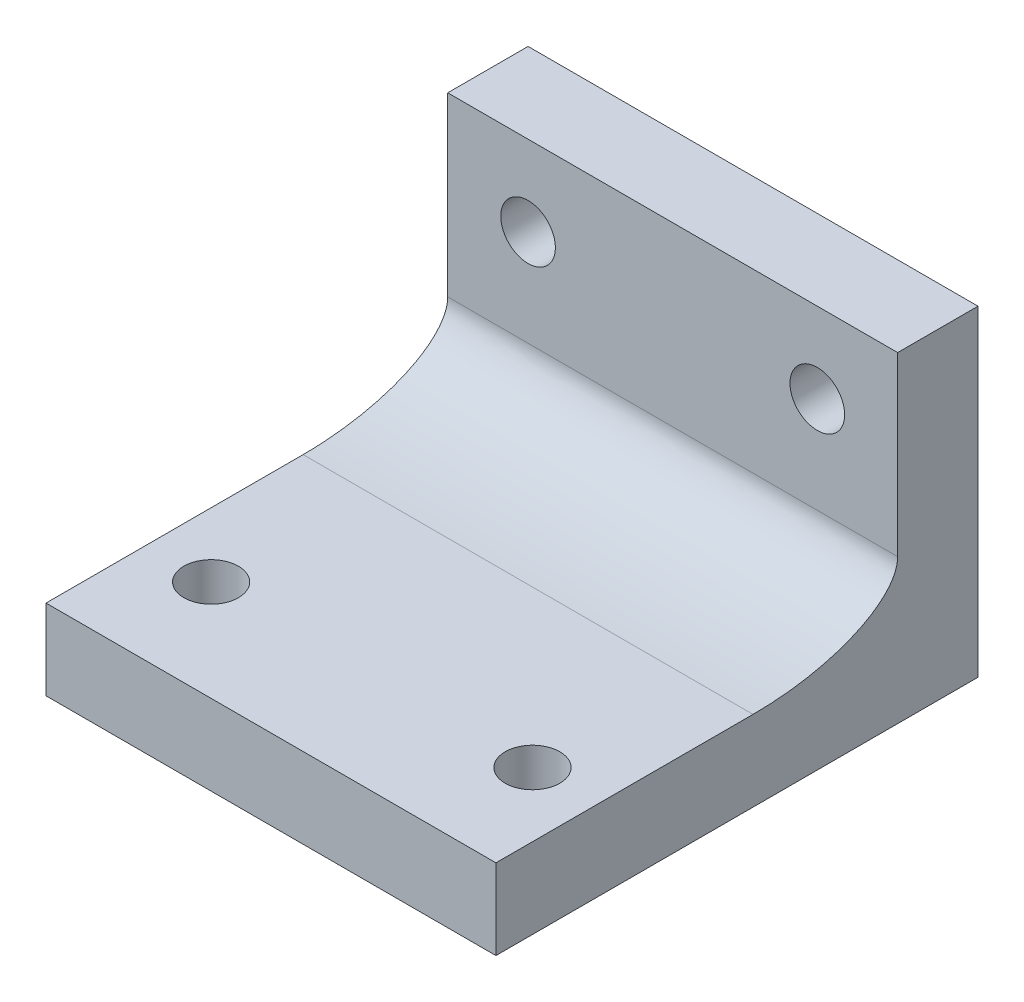
ISO-10303-21;
HEADER;
FILE_DESCRIPTION(('STEP AP214'),'2;1');
FILE_NAME('part.step','',(''),(''),'','','');
FILE_SCHEMA(('AUTOMOTIVE_DESIGN { 1 0 10303 214 1 1 1 1 }'));
ENDSEC;
DATA;
#1=APPLICATION_CONTEXT('core data for automotive mechanical design processes');
#2=APPLICATION_PROTOCOL_DEFINITION('international standard','automotive_design',2000,#1);
#3=PRODUCT_CONTEXT('',#1,'mechanical');
#4=PRODUCT('Part','Part','',(#3));
#5=PRODUCT_RELATED_PRODUCT_CATEGORY('part','',(#4));
#6=PRODUCT_DEFINITION_FORMATION('','',#4);
#7=PRODUCT_DEFINITION_CONTEXT('part definition',#1,'design');
#8=PRODUCT_DEFINITION('design','',#6,#7);
#9=PRODUCT_DEFINITION_SHAPE('','',#8);
#10=(LENGTH_UNIT() NAMED_UNIT(*) SI_UNIT(.MILLI.,.METRE.));
#11=(NAMED_UNIT(*) PLANE_ANGLE_UNIT() SI_UNIT($,.RADIAN.));
#12=(NAMED_UNIT(*) SI_UNIT($,.STERADIAN.) SOLID_ANGLE_UNIT());
#13=UNCERTAINTY_MEASURE_WITH_UNIT(LENGTH_MEASURE(1.E-05),#10,'distance_accuracy_value','');
#14=(GEOMETRIC_REPRESENTATION_CONTEXT(3) GLOBAL_UNCERTAINTY_ASSIGNED_CONTEXT((#13)) GLOBAL_UNIT_ASSIGNED_CONTEXT((#10,
#11,#12)) REPRESENTATION_CONTEXT('',''));
#15=CARTESIAN_POINT('',(0.,0.,0.));
#16=DIRECTION('',(0.,0.,1.));
#17=DIRECTION('',(1.,0.,0.));
#18=AXIS2_PLACEMENT_3D('',#15,#16,#17);
#19=CARTESIAN_POINT('',(0.,5.,0.));
#20=DIRECTION('',(1.,0.,0.));
#21=DIRECTION('',(0.,0.,-1.));
#22=AXIS2_PLACEMENT_3D('',#19,#20,#21);
#23=PLANE('',#22);
#24=DIRECTION('',(0.,0.,1.));
#25=VECTOR('',#24,1.);
#26=CARTESIAN_POINT('',(0.,0.,0.));
#27=LINE('',#26,#25);
#28=CARTESIAN_POINT('',(0.,0.,0.));
#29=VERTEX_POINT('',#28);
#30=CARTESIAN_POINT('',(0.,0.,30.));
#31=VERTEX_POINT('',#30);
#32=EDGE_CURVE('E132',#29,#31,#27,.T.);
#33=ORIENTED_EDGE('',*,*,#32,.T.);
#34=DIRECTION('',(0.,-1.,0.));
#35=VECTOR('',#34,1.);
#36=CARTESIAN_POINT('',(0.,5.,30.));
#37=LINE('',#36,#35);
#38=CARTESIAN_POINT('',(0.,5.,30.));
#39=VERTEX_POINT('',#38);
#40=EDGE_CURVE('E172',#39,#31,#37,.T.);
#41=ORIENTED_EDGE('',*,*,#40,.F.);
#42=DIRECTION('',(0.,0.,1.));
#43=VECTOR('',#42,1.);
#44=CARTESIAN_POINT('',(0.,5.,0.));
#45=LINE('',#44,#43);
#46=CARTESIAN_POINT('',(0.,5.,14.));
#47=VERTEX_POINT('',#46);
#48=EDGE_CURVE('E151',#47,#39,#45,.T.);
#49=ORIENTED_EDGE('',*,*,#48,.F.);
#50=CARTESIAN_POINT('',(0.,9.,5.));
#51=CARTESIAN_POINT('',(0.,5.,5.));
#52=CARTESIAN_POINT('',(0.,5.,14.));
#53=(BOUNDED_CURVE() B_SPLINE_CURVE(2,(#50,#51,#52),.UNSPECIFIED.,.F.,
.F.) B_SPLINE_CURVE_WITH_KNOTS((3,3),(0.,1.),
.UNSPECIFIED.) CURVE() GEOMETRIC_REPRESENTATION_ITEM() RATIONAL_B_SPLINE_CURVE((1.,
0.707106781186548,1.)) REPRESENTATION_ITEM(''));
#54=CARTESIAN_POINT('',(0.,9.,5.));
#55=VERTEX_POINT('',#54);
#56=EDGE_CURVE('E12',#47,#55,#53,.F.);
#57=ORIENTED_EDGE('',*,*,#56,.T.);
#58=DIRECTION('',(0.,-1.,0.));
#59=VECTOR('',#58,1.);
#60=CARTESIAN_POINT('',(0.,20.,5.));
#61=LINE('',#60,#59);
#62=CARTESIAN_POINT('',(0.,20.,5.));
#63=VERTEX_POINT('',#62);
#64=EDGE_CURVE('E111',#63,#55,#61,.T.);
#65=ORIENTED_EDGE('',*,*,#64,.F.);
#66=DIRECTION('',(0.,0.,1.));
#67=VECTOR('',#66,1.);
#68=CARTESIAN_POINT('',(0.,20.,0.));
#69=LINE('',#68,#67);
#70=CARTESIAN_POINT('',(0.,20.,0.));
#71=VERTEX_POINT('',#70);
#72=EDGE_CURVE('E118',#71,#63,#69,.T.);
#73=ORIENTED_EDGE('',*,*,#72,.F.);
#74=DIRECTION('',(0.,-1.,0.));
#75=VECTOR('',#74,1.);
#76=CARTESIAN_POINT('',(0.,5.,0.));
#77=LINE('',#76,#75);
#78=EDGE_CURVE('E158',#71,#29,#77,.T.);
#79=ORIENTED_EDGE('',*,*,#78,.T.);
#80=EDGE_LOOP('',(#33,#41,#49,#57,#65,#73,#79));
#81=FACE_BOUND('',#80,.T.);
#82=ADVANCED_FACE('F40',(#81),#23,.F.);
#83=CARTESIAN_POINT('',(0.,5.,30.));
#84=DIRECTION('',(0.,0.,-1.));
#85=DIRECTION('',(-1.,0.,0.));
#86=AXIS2_PLACEMENT_3D('',#83,#84,#85);
#87=PLANE('',#86);
#88=DIRECTION('',(1.,0.,0.));
#89=VECTOR('',#88,1.);
#90=CARTESIAN_POINT('',(0.,0.,30.));
#91=LINE('',#90,#89);
#92=CARTESIAN_POINT('',(28.,0.,30.));
#93=VERTEX_POINT('',#92);
#94=EDGE_CURVE('E134',#31,#93,#91,.T.);
#95=ORIENTED_EDGE('',*,*,#94,.T.);
#96=DIRECTION('',(0.,-1.,0.));
#97=VECTOR('',#96,1.);
#98=CARTESIAN_POINT('',(28.,5.,30.));
#99=LINE('',#98,#97);
#100=CARTESIAN_POINT('',(28.,5.,30.));
#101=VERTEX_POINT('',#100);
#102=EDGE_CURVE('E170',#101,#93,#99,.T.);
#103=ORIENTED_EDGE('',*,*,#102,.F.);
#104=DIRECTION('',(1.,0.,0.));
#105=VECTOR('',#104,1.);
#106=CARTESIAN_POINT('',(0.,5.,30.));
#107=LINE('',#106,#105);
#108=EDGE_CURVE('E148',#39,#101,#107,.T.);
#109=ORIENTED_EDGE('',*,*,#108,.F.);
#110=ORIENTED_EDGE('',*,*,#40,.T.);
#111=EDGE_LOOP('',(#95,#103,#109,#110));
#112=FACE_BOUND('',#111,.T.);
#113=ADVANCED_FACE('F234',(#112),#87,.F.);
#114=CARTESIAN_POINT('',(28.,5.,0.));
#115=DIRECTION('',(-1.,0.,0.));
#116=DIRECTION('',(0.,0.,1.));
#117=AXIS2_PLACEMENT_3D('',#114,#115,#116);
#118=PLANE('',#117);
#119=DIRECTION('',(0.,0.,-1.));
#120=VECTOR('',#119,1.);
#121=CARTESIAN_POINT('',(28.,0.,0.));
#122=LINE('',#121,#120);
#123=CARTESIAN_POINT('',(28.,0.,0.));
#124=VERTEX_POINT('',#123);
#125=EDGE_CURVE('E163',#93,#124,#122,.T.);
#126=ORIENTED_EDGE('',*,*,#125,.T.);
#127=DIRECTION('',(0.,-1.,0.));
#128=VECTOR('',#127,1.);
#129=CARTESIAN_POINT('',(28.,5.,0.));
#130=LINE('',#129,#128);
#131=CARTESIAN_POINT('',(28.,20.,0.));
#132=VERTEX_POINT('',#131);
#133=EDGE_CURVE('E167',#132,#124,#130,.T.);
#134=ORIENTED_EDGE('',*,*,#133,.F.);
#135=DIRECTION('',(0.,0.,-1.));
#136=VECTOR('',#135,1.);
#137=CARTESIAN_POINT('',(28.,20.,0.));
#138=LINE('',#137,#136);
#139=CARTESIAN_POINT('',(28.,20.,5.));
#140=VERTEX_POINT('',#139);
#141=EDGE_CURVE('E117',#140,#132,#138,.T.);
#142=ORIENTED_EDGE('',*,*,#141,.F.);
#143=DIRECTION('',(0.,-1.,0.));
#144=VECTOR('',#143,1.);
#145=CARTESIAN_POINT('',(28.,20.,5.));
#146=LINE('',#145,#144);
#147=CARTESIAN_POINT('',(28.,9.,5.));
#148=VERTEX_POINT('',#147);
#149=EDGE_CURVE('E113',#140,#148,#146,.T.);
#150=ORIENTED_EDGE('',*,*,#149,.T.);
#151=CARTESIAN_POINT('',(28.,5.,14.));
#152=CARTESIAN_POINT('',(28.,5.,5.));
#153=CARTESIAN_POINT('',(28.,9.,5.));
#154=(BOUNDED_CURVE() B_SPLINE_CURVE(2,(#151,#152,#153),.UNSPECIFIED.,.F.,
.F.) B_SPLINE_CURVE_WITH_KNOTS((3,3),(0.,1.),
.UNSPECIFIED.) CURVE() GEOMETRIC_REPRESENTATION_ITEM() RATIONAL_B_SPLINE_CURVE((1.,
0.707106781186548,1.)) REPRESENTATION_ITEM(''));
#155=CARTESIAN_POINT('',(28.,5.,14.));
#156=VERTEX_POINT('',#155);
#157=EDGE_CURVE('E54',#148,#156,#154,.F.);
#158=ORIENTED_EDGE('',*,*,#157,.T.);
#159=DIRECTION('',(0.,0.,-1.));
#160=VECTOR('',#159,1.);
#161=CARTESIAN_POINT('',(28.,5.,0.));
#162=LINE('',#161,#160);
#163=EDGE_CURVE('E157',#101,#156,#162,.T.);
#164=ORIENTED_EDGE('',*,*,#163,.F.);
#165=ORIENTED_EDGE('',*,*,#102,.T.);
#166=EDGE_LOOP('',(#126,#134,#142,#150,#158,#164,#165));
#167=FACE_BOUND('',#166,.T.);
#168=ADVANCED_FACE('F180',(#167),#118,.F.);
#169=CARTESIAN_POINT('',(0.,5.,0.));
#170=DIRECTION('',(0.,0.,1.));
#171=DIRECTION('',(1.,0.,0.));
#172=AXIS2_PLACEMENT_3D('',#169,#170,#171);
#173=PLANE('',#172);
#174=CARTESIAN_POINT('',(5.,15.,0.));
#175=DIRECTION('',(0.,0.,1.));
#176=DIRECTION('',(1.,0.,0.));
#177=AXIS2_PLACEMENT_3D('',#174,#175,#176);
#178=CIRCLE('',#177,1.7);
#179=CARTESIAN_POINT('',(6.7,15.,0.));
#180=VERTEX_POINT('',#179);
#181=EDGE_CURVE('E187',#180,#180,#178,.T.);
#182=ORIENTED_EDGE('',*,*,#181,.T.);
#183=EDGE_LOOP('',(#182));
#184=FACE_BOUND('',#183,.T.);
#185=CARTESIAN_POINT('',(23.,15.,0.));
#186=DIRECTION('',(0.,0.,1.));
#187=DIRECTION('',(-1.,0.,0.));
#188=AXIS2_PLACEMENT_3D('',#185,#186,#187);
#189=CIRCLE('',#188,1.7);
#190=CARTESIAN_POINT('',(21.3,15.,0.));
#191=VERTEX_POINT('',#190);
#192=EDGE_CURVE('E198',#191,#191,#189,.T.);
#193=ORIENTED_EDGE('',*,*,#192,.T.);
#194=EDGE_LOOP('',(#193));
#195=FACE_BOUND('',#194,.T.);
#196=DIRECTION('',(-1.,0.,0.));
#197=VECTOR('',#196,1.);
#198=CARTESIAN_POINT('',(0.,0.,0.));
#199=LINE('',#198,#197);
#200=EDGE_CURVE('E153',#124,#29,#199,.T.);
#201=ORIENTED_EDGE('',*,*,#200,.T.);
#202=ORIENTED_EDGE('',*,*,#78,.F.);
#203=DIRECTION('',(-1.,0.,0.));
#204=VECTOR('',#203,1.);
#205=CARTESIAN_POINT('',(0.,20.,0.));
#206=LINE('',#205,#204);
#207=EDGE_CURVE('E124',#132,#71,#206,.T.);
#208=ORIENTED_EDGE('',*,*,#207,.F.);
#209=ORIENTED_EDGE('',*,*,#133,.T.);
#210=EDGE_LOOP('',(#201,#202,#208,#209));
#211=FACE_BOUND('',#210,.T.);
#212=ADVANCED_FACE('F207',(#184,#195,#211),#173,.F.);
#213=CARTESIAN_POINT('',(0.,5.,0.));
#214=DIRECTION('',(0.,1.,0.));
#215=DIRECTION('',(0.,0.,1.));
#216=AXIS2_PLACEMENT_3D('',#213,#214,#215);
#217=PLANE('',#216);
#218=CARTESIAN_POINT('',(4.,5.,23.725));
#219=DIRECTION('',(0.,1.,0.));
#220=DIRECTION('',(0.,0.,1.));
#221=AXIS2_PLACEMENT_3D('',#218,#219,#220);
#222=CIRCLE('',#221,1.7);
#223=CARTESIAN_POINT('',(4.,5.,25.425));
#224=VERTEX_POINT('',#223);
#225=EDGE_CURVE('E190',#224,#224,#222,.T.);
#226=ORIENTED_EDGE('',*,*,#225,.F.);
#227=EDGE_LOOP('',(#226));
#228=FACE_BOUND('',#227,.T.);
#229=CARTESIAN_POINT('',(24.,5.,23.725));
#230=DIRECTION('',(0.,1.,0.));
#231=DIRECTION('',(0.,0.,-1.));
#232=AXIS2_PLACEMENT_3D('',#229,#230,#231);
#233=CIRCLE('',#232,1.7);
#234=CARTESIAN_POINT('',(24.,5.,22.025));
#235=VERTEX_POINT('',#234);
#236=EDGE_CURVE('E183',#235,#235,#233,.T.);
#237=ORIENTED_EDGE('',*,*,#236,.F.);
#238=EDGE_LOOP('',(#237));
#239=FACE_BOUND('',#238,.T.);
#240=ORIENTED_EDGE('',*,*,#163,.T.);
#241=CARTESIAN_POINT('',(-1.4,5.,14.));
#242=CARTESIAN_POINT('',(8.86666666666667,5.,14.));
#243=CARTESIAN_POINT('',(19.1333333333333,5.,14.));
#244=CARTESIAN_POINT('',(29.4,5.,14.));
#245=(BOUNDED_CURVE() B_SPLINE_CURVE(3,(#241,#242,#243,#244),.UNSPECIFIED.,.F.,
.F.) B_SPLINE_CURVE_WITH_KNOTS((4,4),(-0.0014,0.0294),
.UNSPECIFIED.) CURVE() GEOMETRIC_REPRESENTATION_ITEM() RATIONAL_B_SPLINE_CURVE((1.,1.,1.,1.)) REPRESENTATION_ITEM(''));
#246=EDGE_CURVE('E68',#156,#47,#245,.F.);
#247=ORIENTED_EDGE('',*,*,#246,.T.);
#248=ORIENTED_EDGE('',*,*,#48,.T.);
#249=ORIENTED_EDGE('',*,*,#108,.T.);
#250=EDGE_LOOP('',(#240,#247,#248,#249));
#251=FACE_BOUND('',#250,.T.);
#252=ADVANCED_FACE('F297',(#228,#239,#251),#217,.T.);
#253=CARTESIAN_POINT('',(0.,0.,0.));
#254=DIRECTION('',(0.,1.,0.));
#255=DIRECTION('',(0.,0.,1.));
#256=AXIS2_PLACEMENT_3D('',#253,#254,#255);
#257=PLANE('',#256);
#258=CARTESIAN_POINT('',(4.,0.,23.725));
#259=DIRECTION('',(0.,1.,0.));
#260=DIRECTION('',(0.,0.,1.));
#261=AXIS2_PLACEMENT_3D('',#258,#259,#260);
#262=CIRCLE('',#261,1.7);
#263=CARTESIAN_POINT('',(4.,0.,25.425));
#264=VERTEX_POINT('',#263);
#265=EDGE_CURVE('E127',#264,#264,#262,.T.);
#266=ORIENTED_EDGE('',*,*,#265,.T.);
#267=EDGE_LOOP('',(#266));
#268=FACE_BOUND('',#267,.T.);
#269=CARTESIAN_POINT('',(24.,0.,23.725));
#270=DIRECTION('',(0.,1.,0.));
#271=DIRECTION('',(0.,0.,-1.));
#272=AXIS2_PLACEMENT_3D('',#269,#270,#271);
#273=CIRCLE('',#272,1.7);
#274=CARTESIAN_POINT('',(24.,0.,22.025));
#275=VERTEX_POINT('',#274);
#276=EDGE_CURVE('E186',#275,#275,#273,.T.);
#277=ORIENTED_EDGE('',*,*,#276,.T.);
#278=EDGE_LOOP('',(#277));
#279=FACE_BOUND('',#278,.T.);
#280=ORIENTED_EDGE('',*,*,#32,.F.);
#281=ORIENTED_EDGE('',*,*,#200,.F.);
#282=ORIENTED_EDGE('',*,*,#125,.F.);
#283=ORIENTED_EDGE('',*,*,#94,.F.);
#284=EDGE_LOOP('',(#280,#281,#282,#283));
#285=FACE_BOUND('',#284,.T.);
#286=ADVANCED_FACE('F219',(#268,#279,#285),#257,.F.);
#287=CARTESIAN_POINT('',(0.,20.,5.));
#288=DIRECTION('',(0.,0.,-1.));
#289=DIRECTION('',(-1.,0.,0.));
#290=AXIS2_PLACEMENT_3D('',#287,#288,#289);
#291=PLANE('',#290);
#292=CARTESIAN_POINT('',(5.,15.,5.));
#293=DIRECTION('',(0.,0.,1.));
#294=DIRECTION('',(1.,0.,0.));
#295=AXIS2_PLACEMENT_3D('',#292,#293,#294);
#296=CIRCLE('',#295,1.7);
#297=CARTESIAN_POINT('',(6.7,15.,5.));
#298=VERTEX_POINT('',#297);
#299=EDGE_CURVE('E201',#298,#298,#296,.T.);
#300=ORIENTED_EDGE('',*,*,#299,.F.);
#301=EDGE_LOOP('',(#300));
#302=FACE_BOUND('',#301,.T.);
#303=CARTESIAN_POINT('',(23.,15.,5.));
#304=DIRECTION('',(0.,0.,1.));
#305=DIRECTION('',(-1.,0.,0.));
#306=AXIS2_PLACEMENT_3D('',#303,#304,#305);
#307=CIRCLE('',#306,1.7);
#308=CARTESIAN_POINT('',(21.3,15.,5.));
#309=VERTEX_POINT('',#308);
#310=EDGE_CURVE('E195',#309,#309,#307,.T.);
#311=ORIENTED_EDGE('',*,*,#310,.F.);
#312=EDGE_LOOP('',(#311));
#313=FACE_BOUND('',#312,.T.);
#314=ORIENTED_EDGE('',*,*,#64,.T.);
#315=CARTESIAN_POINT('',(29.4,9.,5.));
#316=CARTESIAN_POINT('',(19.1333333333333,9.,5.));
#317=CARTESIAN_POINT('',(8.86666666666667,9.,5.));
#318=CARTESIAN_POINT('',(-1.4,9.,5.));
#319=(BOUNDED_CURVE() B_SPLINE_CURVE(3,(#315,#316,#317,#318),.UNSPECIFIED.,.F.,
.F.) B_SPLINE_CURVE_WITH_KNOTS((4,4),(-0.0014,0.0294),
.UNSPECIFIED.) CURVE() GEOMETRIC_REPRESENTATION_ITEM() RATIONAL_B_SPLINE_CURVE((1.,1.,1.,1.)) REPRESENTATION_ITEM(''));
#320=EDGE_CURVE('E174',#55,#148,#319,.F.);
#321=ORIENTED_EDGE('',*,*,#320,.T.);
#322=ORIENTED_EDGE('',*,*,#149,.F.);
#323=DIRECTION('',(1.,0.,0.));
#324=VECTOR('',#323,1.);
#325=CARTESIAN_POINT('',(0.,20.,5.));
#326=LINE('',#325,#324);
#327=EDGE_CURVE('E106',#63,#140,#326,.T.);
#328=ORIENTED_EDGE('',*,*,#327,.F.);
#329=EDGE_LOOP('',(#314,#321,#322,#328));
#330=FACE_BOUND('',#329,.T.);
#331=ADVANCED_FACE('F108',(#302,#313,#330),#291,.F.);
#332=CARTESIAN_POINT('',(0.,20.,0.));
#333=DIRECTION('',(0.,1.,0.));
#334=DIRECTION('',(0.,0.,1.));
#335=AXIS2_PLACEMENT_3D('',#332,#333,#334);
#336=PLANE('',#335);
#337=ORIENTED_EDGE('',*,*,#72,.T.);
#338=ORIENTED_EDGE('',*,*,#327,.T.);
#339=ORIENTED_EDGE('',*,*,#141,.T.);
#340=ORIENTED_EDGE('',*,*,#207,.T.);
#341=EDGE_LOOP('',(#337,#338,#339,#340));
#342=FACE_BOUND('',#341,.T.);
#343=ADVANCED_FACE('F122',(#342),#336,.T.);
#344=CARTESIAN_POINT('',(24.,0.,23.725));
#345=DIRECTION('',(0.,1.,0.));
#346=DIRECTION('',(0.,0.,1.));
#347=AXIS2_PLACEMENT_3D('',#344,#345,#346);
#348=CYLINDRICAL_SURFACE('',#347,1.7);
#349=ORIENTED_EDGE('',*,*,#276,.F.);
#350=EDGE_LOOP('',(#349));
#351=FACE_BOUND('',#350,.T.);
#352=ORIENTED_EDGE('',*,*,#236,.T.);
#353=EDGE_LOOP('',(#352));
#354=FACE_BOUND('',#353,.T.);
#355=ADVANCED_FACE('F229',(#351,#354),#348,.F.);
#356=CARTESIAN_POINT('',(4.,0.,23.725));
#357=DIRECTION('',(0.,1.,0.));
#358=DIRECTION('',(0.,0.,1.));
#359=AXIS2_PLACEMENT_3D('',#356,#357,#358);
#360=CYLINDRICAL_SURFACE('',#359,1.7);
#361=ORIENTED_EDGE('',*,*,#265,.F.);
#362=EDGE_LOOP('',(#361));
#363=FACE_BOUND('',#362,.T.);
#364=ORIENTED_EDGE('',*,*,#225,.T.);
#365=EDGE_LOOP('',(#364));
#366=FACE_BOUND('',#365,.T.);
#367=ADVANCED_FACE('F223',(#363,#366),#360,.F.);
#368=CARTESIAN_POINT('',(23.,15.,0.));
#369=DIRECTION('',(0.,0.,1.));
#370=DIRECTION('',(1.,0.,0.));
#371=AXIS2_PLACEMENT_3D('',#368,#369,#370);
#372=CYLINDRICAL_SURFACE('',#371,1.7);
#373=ORIENTED_EDGE('',*,*,#192,.F.);
#374=EDGE_LOOP('',(#373));
#375=FACE_BOUND('',#374,.T.);
#376=ORIENTED_EDGE('',*,*,#310,.T.);
#377=EDGE_LOOP('',(#376));
#378=FACE_BOUND('',#377,.T.);
#379=ADVANCED_FACE('F213',(#375,#378),#372,.F.);
#380=CARTESIAN_POINT('',(5.,15.,0.));
#381=DIRECTION('',(0.,0.,1.));
#382=DIRECTION('',(1.,0.,0.));
#383=AXIS2_PLACEMENT_3D('',#380,#381,#382);
#384=CYLINDRICAL_SURFACE('',#383,1.7);
#385=ORIENTED_EDGE('',*,*,#181,.F.);
#386=EDGE_LOOP('',(#385));
#387=FACE_BOUND('',#386,.T.);
#388=ORIENTED_EDGE('',*,*,#299,.T.);
#389=EDGE_LOOP('',(#388));
#390=FACE_BOUND('',#389,.T.);
#391=ADVANCED_FACE('F210',(#387,#390),#384,.F.);
#392=CARTESIAN_POINT('',(-1.4,9.,5.));
#393=CARTESIAN_POINT('',(8.86666666666667,9.,5.));
#394=CARTESIAN_POINT('',(19.1333333333333,9.,5.));
#395=CARTESIAN_POINT('',(29.4,9.,5.));
#396=CARTESIAN_POINT('',(-1.4,5.,5.));
#397=CARTESIAN_POINT('',(8.86666666666665,5.,5.));
#398=CARTESIAN_POINT('',(19.1333333333333,5.,5.));
#399=CARTESIAN_POINT('',(29.4,5.,5.));
#400=CARTESIAN_POINT('',(-1.4,5.,14.));
#401=CARTESIAN_POINT('',(8.86666666666667,5.,14.));
#402=CARTESIAN_POINT('',(19.1333333333333,5.,14.));
#403=CARTESIAN_POINT('',(29.4,5.,14.));
#404=(BOUNDED_SURFACE() B_SPLINE_SURFACE(2,3,((#392,#393,#394,#395),(#396,#397,#398,#399),(#400,
#401,#402,#403)),.UNSPECIFIED.,.F.,.F.,.F.) B_SPLINE_SURFACE_WITH_KNOTS((3,3),(4,4),(0.,1.),
(-0.0014,0.0294),.UNSPECIFIED.) GEOMETRIC_REPRESENTATION_ITEM() RATIONAL_B_SPLINE_SURFACE(((1.,
1.,1.,1.),(0.707106781186548,0.707106781186548,0.707106781186548,0.707106781186548),(1.,1.,1.,1.))) REPRESENTATION_ITEM('') SURFACE());
#405=ORIENTED_EDGE('',*,*,#56,.F.);
#406=ORIENTED_EDGE('',*,*,#246,.F.);
#407=ORIENTED_EDGE('',*,*,#157,.F.);
#408=ORIENTED_EDGE('',*,*,#320,.F.);
#409=EDGE_LOOP('',(#405,#406,#407,#408));
#410=FACE_BOUND('',#409,.T.);
#411=ADVANCED_FACE('F43',(#410),#404,.T.);
#412=CLOSED_SHELL('',(#82,#113,#168,#212,#252,#286,#331,#343,#355,#367,#379,#391,#411));
#413=MANIFOLD_SOLID_BREP('B2',#412);
#414=ADVANCED_BREP_SHAPE_REPRESENTATION('',(#18,#413),#14);
#415=SHAPE_DEFINITION_REPRESENTATION(#9,#414);
ENDSEC;
END-ISO-10303-21;
